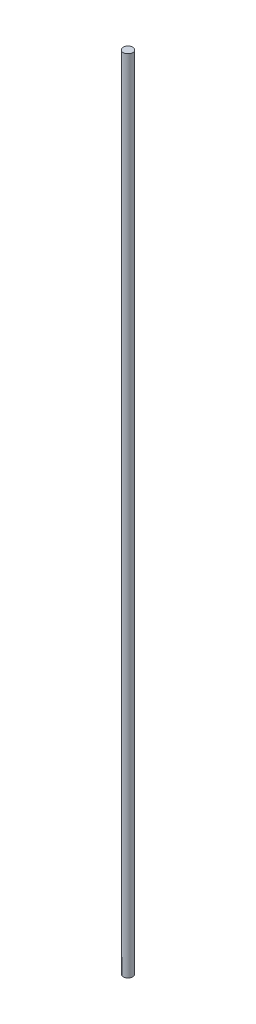
ISO-10303-21;
HEADER;
FILE_DESCRIPTION(('STEP AP214'),'2;1');
FILE_NAME('part.step','',(''),(''),'','','');
FILE_SCHEMA(('AUTOMOTIVE_DESIGN { 1 0 10303 214 1 1 1 1 }'));
ENDSEC;
DATA;
#1=APPLICATION_CONTEXT('core data for automotive mechanical design processes');
#2=APPLICATION_PROTOCOL_DEFINITION('international standard','automotive_design',2000,#1);
#3=PRODUCT_CONTEXT('',#1,'mechanical');
#4=PRODUCT('Part','Part','',(#3));
#5=PRODUCT_RELATED_PRODUCT_CATEGORY('part','',(#4));
#6=PRODUCT_DEFINITION_FORMATION('','',#4);
#7=PRODUCT_DEFINITION_CONTEXT('part definition',#1,'design');
#8=PRODUCT_DEFINITION('design','',#6,#7);
#9=PRODUCT_DEFINITION_SHAPE('','',#8);
#10=(LENGTH_UNIT() NAMED_UNIT(*) SI_UNIT(.MILLI.,.METRE.));
#11=(NAMED_UNIT(*) PLANE_ANGLE_UNIT() SI_UNIT($,.RADIAN.));
#12=(NAMED_UNIT(*) SI_UNIT($,.STERADIAN.) SOLID_ANGLE_UNIT());
#13=UNCERTAINTY_MEASURE_WITH_UNIT(LENGTH_MEASURE(1.E-05),#10,'distance_accuracy_value','');
#14=(GEOMETRIC_REPRESENTATION_CONTEXT(3) GLOBAL_UNCERTAINTY_ASSIGNED_CONTEXT((#13)) GLOBAL_UNIT_ASSIGNED_CONTEXT((#10,
#11,#12)) REPRESENTATION_CONTEXT('',''));
#15=CARTESIAN_POINT('',(0.,0.,0.));
#16=DIRECTION('',(0.,0.,1.));
#17=DIRECTION('',(1.,0.,0.));
#18=AXIS2_PLACEMENT_3D('',#15,#16,#17);
#19=CARTESIAN_POINT('',(0.,335.,0.));
#20=DIRECTION('',(0.,-1.,0.));
#21=DIRECTION('',(0.,0.,-1.));
#22=AXIS2_PLACEMENT_3D('',#19,#20,#21);
#23=CYLINDRICAL_SURFACE('',#22,3.97);
#24=CARTESIAN_POINT('',(0.,335.,0.));
#25=DIRECTION('',(0.,1.,0.));
#26=DIRECTION('',(0.,0.,1.));
#27=AXIS2_PLACEMENT_3D('',#24,#25,#26);
#28=CIRCLE('',#27,3.97);
#29=CARTESIAN_POINT('',(0.,335.,3.97));
#30=VERTEX_POINT('',#29);
#31=EDGE_CURVE('E10',#30,#30,#28,.T.);
#32=ORIENTED_EDGE('',*,*,#31,.F.);
#33=EDGE_LOOP('',(#32));
#34=FACE_BOUND('',#33,.T.);
#35=CARTESIAN_POINT('',(0.,-335.,0.));
#36=DIRECTION('',(0.,1.,0.));
#37=DIRECTION('',(0.,0.,1.));
#38=AXIS2_PLACEMENT_3D('',#35,#36,#37);
#39=CIRCLE('',#38,3.97);
#40=CARTESIAN_POINT('',(0.,-335.,3.97));
#41=VERTEX_POINT('',#40);
#42=EDGE_CURVE('E39',#41,#41,#39,.T.);
#43=ORIENTED_EDGE('',*,*,#42,.T.);
#44=EDGE_LOOP('',(#43));
#45=FACE_BOUND('',#44,.T.);
#46=ADVANCED_FACE('F36',(#34,#45),#23,.T.);
#47=CARTESIAN_POINT('',(0.,335.,0.));
#48=DIRECTION('',(0.,1.,0.));
#49=DIRECTION('',(0.,0.,1.));
#50=AXIS2_PLACEMENT_3D('',#47,#48,#49);
#51=PLANE('',#50);
#52=ORIENTED_EDGE('',*,*,#31,.T.);
#53=EDGE_LOOP('',(#52));
#54=FACE_BOUND('',#53,.T.);
#55=ADVANCED_FACE('F51',(#54),#51,.T.);
#56=CARTESIAN_POINT('',(0.,-335.,0.));
#57=DIRECTION('',(0.,1.,0.));
#58=DIRECTION('',(0.,0.,1.));
#59=AXIS2_PLACEMENT_3D('',#56,#57,#58);
#60=PLANE('',#59);
#61=ORIENTED_EDGE('',*,*,#42,.F.);
#62=EDGE_LOOP('',(#61));
#63=FACE_BOUND('',#62,.T.);
#64=ADVANCED_FACE('F49',(#63),#60,.F.);
#65=CLOSED_SHELL('',(#46,#55,#64));
#66=MANIFOLD_SOLID_BREP('B2',#65);
#67=ADVANCED_BREP_SHAPE_REPRESENTATION('',(#18,#66),#14);
#68=SHAPE_DEFINITION_REPRESENTATION(#9,#67);
ENDSEC;
END-ISO-10303-21;
